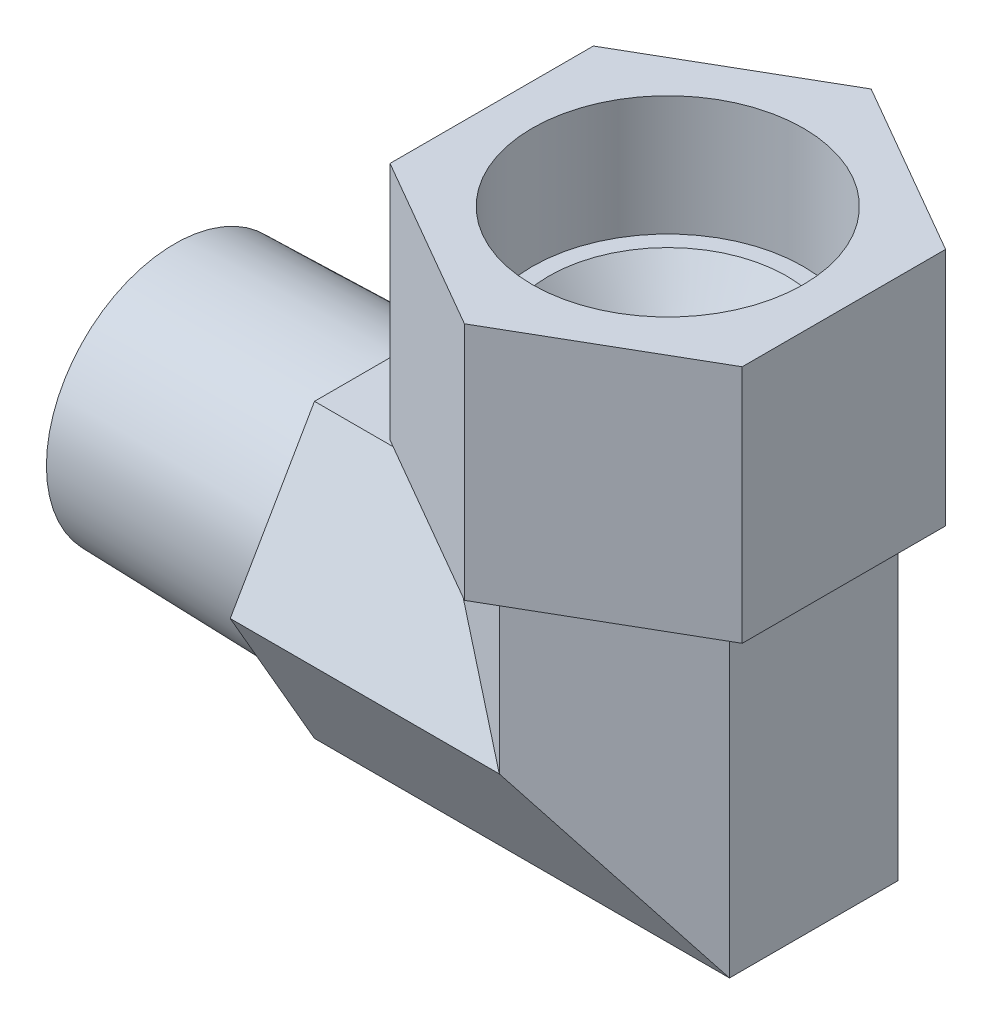
ISO-10303-21;
HEADER;
FILE_DESCRIPTION(('STEP AP214'),'2;1');
FILE_NAME('part.step','',(''),(''),'','','');
FILE_SCHEMA(('AUTOMOTIVE_DESIGN { 1 0 10303 214 1 1 1 1 }'));
ENDSEC;
DATA;
#1=APPLICATION_CONTEXT('core data for automotive mechanical design processes');
#2=APPLICATION_PROTOCOL_DEFINITION('international standard','automotive_design',2000,#1);
#3=PRODUCT_CONTEXT('',#1,'mechanical');
#4=PRODUCT('Part','Part','',(#3));
#5=PRODUCT_RELATED_PRODUCT_CATEGORY('part','',(#4));
#6=PRODUCT_DEFINITION_FORMATION('','',#4);
#7=PRODUCT_DEFINITION_CONTEXT('part definition',#1,'design');
#8=PRODUCT_DEFINITION('design','',#6,#7);
#9=PRODUCT_DEFINITION_SHAPE('','',#8);
#10=(LENGTH_UNIT() NAMED_UNIT(*) SI_UNIT(.MILLI.,.METRE.));
#11=(NAMED_UNIT(*) PLANE_ANGLE_UNIT() SI_UNIT($,.RADIAN.));
#12=(NAMED_UNIT(*) SI_UNIT($,.STERADIAN.) SOLID_ANGLE_UNIT());
#13=UNCERTAINTY_MEASURE_WITH_UNIT(LENGTH_MEASURE(1.E-05),#10,'distance_accuracy_value','');
#14=(GEOMETRIC_REPRESENTATION_CONTEXT(3) GLOBAL_UNCERTAINTY_ASSIGNED_CONTEXT((#13)) GLOBAL_UNIT_ASSIGNED_CONTEXT((#10,
#11,#12)) REPRESENTATION_CONTEXT('',''));
#15=CARTESIAN_POINT('',(0.,0.,0.));
#16=DIRECTION('',(0.,0.,1.));
#17=DIRECTION('',(1.,0.,0.));
#18=AXIS2_PLACEMENT_3D('',#15,#16,#17);
#19=CARTESIAN_POINT('',(44.45,25.908,0.));
#20=DIRECTION('',(0.,1.,0.));
#21=DIRECTION('',(0.,0.,-1.));
#22=AXIS2_PLACEMENT_3D('',#19,#20,#21);
#23=PLANE('',#22);
#24=CARTESIAN_POINT('',(44.45,25.908,0.));
#25=DIRECTION('',(0.,1.,0.));
#26=DIRECTION('',(-1.,0.,0.));
#27=AXIS2_PLACEMENT_3D('',#24,#25,#26);
#28=CIRCLE('',#27,10.7201825681273);
#29=CARTESIAN_POINT('',(33.7298174318727,25.908,0.));
#30=VERTEX_POINT('',#29);
#31=EDGE_CURVE('E349',#30,#30,#28,.F.);
#32=ORIENTED_EDGE('',*,*,#31,.T.);
#33=EDGE_LOOP('',(#32));
#34=FACE_BOUND('',#33,.T.);
#35=CARTESIAN_POINT('',(44.45,25.908,0.));
#36=DIRECTION('',(0.,1.,0.));
#37=DIRECTION('',(-1.,0.,0.));
#38=AXIS2_PLACEMENT_3D('',#35,#36,#37);
#39=CIRCLE('',#38,12.2174);
#40=CARTESIAN_POINT('',(32.2326,25.908,0.));
#41=VERTEX_POINT('',#40);
#42=EDGE_CURVE('E11',#41,#41,#39,.F.);
#43=ORIENTED_EDGE('',*,*,#42,.F.);
#44=EDGE_LOOP('',(#43));
#45=FACE_BOUND('',#44,.T.);
#46=ADVANCED_FACE('F40',(#34,#45),#23,.T.);
#47=CARTESIAN_POINT('',(44.45,-14.57292,-15.1926259235635));
#48=DIRECTION('',(-0.5,0.,-0.866025403784438));
#49=DIRECTION('',(-0.866025403784439,0.,0.5));
#50=AXIS2_PLACEMENT_3D('',#47,#48,#49);
#51=PLANE('',#50);
#52=DIRECTION('',(0.,1.,0.));
#53=VECTOR('',#52,1.);
#54=CARTESIAN_POINT('',(31.2928,-14.57292,-7.59631296178174));
#55=LINE('',#54,#53);
#56=CARTESIAN_POINT('',(31.2928,13.1572,-7.59631296178175));
#57=VERTEX_POINT('',#56);
#58=CARTESIAN_POINT('',(31.2928,15.113,-7.59631296178174));
#59=VERTEX_POINT('',#58);
#60=EDGE_CURVE('E319',#57,#59,#55,.T.);
#61=ORIENTED_EDGE('',*,*,#60,.T.);
#62=DIRECTION('',(0.866025403784439,0.,-0.5));
#63=VECTOR('',#62,1.);
#64=CARTESIAN_POINT('',(44.45,15.113,-15.1926259235635));
#65=LINE('',#64,#63);
#66=CARTESIAN_POINT('',(44.45,15.113,-15.1926259235635));
#67=VERTEX_POINT('',#66);
#68=EDGE_CURVE('E192',#59,#67,#65,.T.);
#69=ORIENTED_EDGE('',*,*,#68,.T.);
#70=DIRECTION('',(0.,1.,0.));
#71=VECTOR('',#70,1.);
#72=CARTESIAN_POINT('',(44.45,-14.57292,-15.1926259235635));
#73=LINE('',#72,#71);
#74=CARTESIAN_POINT('',(44.45,0.,-15.1926259235635));
#75=VERTEX_POINT('',#74);
#76=EDGE_CURVE('E314',#75,#67,#73,.T.);
#77=ORIENTED_EDGE('',*,*,#76,.F.);
#78=DIRECTION('',(0.654653670707977,-0.654653670707977,-0.377964473009227));
#79=VECTOR('',#78,1.);
#80=CARTESIAN_POINT('',(25.4,19.05,-4.19410329550112));
#81=LINE('',#80,#79);
#82=EDGE_CURVE('E310',#57,#75,#81,.T.);
#83=ORIENTED_EDGE('',*,*,#82,.F.);
#84=EDGE_LOOP('',(#61,#69,#77,#83));
#85=FACE_BOUND('',#84,.T.);
#86=ADVANCED_FACE('F248',(#85),#51,.T.);
#87=CARTESIAN_POINT('',(31.2928,-14.57292,-7.59631296178174));
#88=DIRECTION('',(-1.,0.,0.));
#89=DIRECTION('',(0.,0.,1.));
#90=AXIS2_PLACEMENT_3D('',#87,#88,#89);
#91=PLANE('',#90);
#92=DIRECTION('',(0.,1.,0.));
#93=VECTOR('',#92,1.);
#94=CARTESIAN_POINT('',(31.2928,-14.57292,7.59631296178174));
#95=LINE('',#94,#93);
#96=CARTESIAN_POINT('',(31.2928,13.1572,7.59631296178174));
#97=VERTEX_POINT('',#96);
#98=CARTESIAN_POINT('',(31.2928,15.113,7.59631296178174));
#99=VERTEX_POINT('',#98);
#100=EDGE_CURVE('E341',#97,#99,#95,.T.);
#101=ORIENTED_EDGE('',*,*,#100,.T.);
#102=DIRECTION('',(0.,0.,-1.));
#103=VECTOR('',#102,1.);
#104=CARTESIAN_POINT('',(31.2928,15.113,-7.59631296178174));
#105=LINE('',#104,#103);
#106=EDGE_CURVE('E189',#99,#59,#105,.T.);
#107=ORIENTED_EDGE('',*,*,#106,.T.);
#108=ORIENTED_EDGE('',*,*,#60,.F.);
#109=DIRECTION('',(0.,0.,-1.));
#110=VECTOR('',#109,1.);
#111=CARTESIAN_POINT('',(31.2928,13.1572,-7.59631296178174));
#112=LINE('',#111,#110);
#113=EDGE_CURVE('E350',#97,#57,#112,.T.);
#114=ORIENTED_EDGE('',*,*,#113,.F.);
#115=EDGE_LOOP('',(#101,#107,#108,#114));
#116=FACE_BOUND('',#115,.T.);
#117=ADVANCED_FACE('F253',(#116),#91,.T.);
#118=CARTESIAN_POINT('',(31.2928,-14.57292,7.59631296178174));
#119=DIRECTION('',(-0.5,0.,0.866025403784439));
#120=DIRECTION('',(0.866025403784439,0.,0.5));
#121=AXIS2_PLACEMENT_3D('',#118,#119,#120);
#122=PLANE('',#121);
#123=DIRECTION('',(0.,1.,0.));
#124=VECTOR('',#123,1.);
#125=CARTESIAN_POINT('',(44.45,-14.57292,15.1926259235635));
#126=LINE('',#125,#124);
#127=CARTESIAN_POINT('',(44.45,0.,15.1926259235635));
#128=VERTEX_POINT('',#127);
#129=CARTESIAN_POINT('',(44.45,15.113,15.1926259235635));
#130=VERTEX_POINT('',#129);
#131=EDGE_CURVE('E338',#128,#130,#126,.T.);
#132=ORIENTED_EDGE('',*,*,#131,.T.);
#133=DIRECTION('',(-0.866025403784439,0.,-0.5));
#134=VECTOR('',#133,1.);
#135=CARTESIAN_POINT('',(31.2928,15.113,7.59631296178174));
#136=LINE('',#135,#134);
#137=EDGE_CURVE('E186',#130,#99,#136,.T.);
#138=ORIENTED_EDGE('',*,*,#137,.T.);
#139=ORIENTED_EDGE('',*,*,#100,.F.);
#140=DIRECTION('',(-0.654653670707977,0.654653670707977,-0.377964473009227));
#141=VECTOR('',#140,1.);
#142=CARTESIAN_POINT('',(17.8816,26.5684,-0.146646968374165));
#143=LINE('',#142,#141);
#144=EDGE_CURVE('E361',#128,#97,#143,.T.);
#145=ORIENTED_EDGE('',*,*,#144,.F.);
#146=EDGE_LOOP('',(#132,#138,#139,#145));
#147=FACE_BOUND('',#146,.T.);
#148=ADVANCED_FACE('F275',(#147),#122,.T.);
#149=CARTESIAN_POINT('',(44.45,-14.57292,15.1926259235635));
#150=DIRECTION('',(0.5,0.,0.866025403784438));
#151=DIRECTION('',(0.866025403784439,0.,-0.5));
#152=AXIS2_PLACEMENT_3D('',#149,#150,#151);
#153=PLANE('',#152);
#154=DIRECTION('',(0.,1.,0.));
#155=VECTOR('',#154,1.);
#156=CARTESIAN_POINT('',(57.6072,-14.57292,7.59631296178174));
#157=LINE('',#156,#155);
#158=CARTESIAN_POINT('',(57.6072,-13.1572,7.59631296178174));
#159=VERTEX_POINT('',#158);
#160=CARTESIAN_POINT('',(57.6072,15.113,7.59631296178174));
#161=VERTEX_POINT('',#160);
#162=EDGE_CURVE('E335',#159,#161,#157,.T.);
#163=ORIENTED_EDGE('',*,*,#162,.T.);
#164=DIRECTION('',(-0.866025403784439,0.,0.5));
#165=VECTOR('',#164,1.);
#166=CARTESIAN_POINT('',(44.45,15.113,15.1926259235635));
#167=LINE('',#166,#165);
#168=EDGE_CURVE('E178',#161,#130,#167,.T.);
#169=ORIENTED_EDGE('',*,*,#168,.T.);
#170=ORIENTED_EDGE('',*,*,#131,.F.);
#171=DIRECTION('',(-0.654653670707977,0.654653670707977,0.377964473009227));
#172=VECTOR('',#171,1.);
#173=CARTESIAN_POINT('',(25.4,19.05,26.1911485516259));
#174=LINE('',#173,#172);
#175=EDGE_CURVE('E358',#159,#128,#174,.T.);
#176=ORIENTED_EDGE('',*,*,#175,.F.);
#177=EDGE_LOOP('',(#163,#169,#170,#176));
#178=FACE_BOUND('',#177,.T.);
#179=ADVANCED_FACE('F271',(#178),#153,.T.);
#180=CARTESIAN_POINT('',(57.6072,-14.57292,7.59631296178174));
#181=DIRECTION('',(1.,0.,0.));
#182=DIRECTION('',(0.,0.,-1.));
#183=AXIS2_PLACEMENT_3D('',#180,#181,#182);
#184=PLANE('',#183);
#185=DIRECTION('',(0.,1.,0.));
#186=VECTOR('',#185,1.);
#187=CARTESIAN_POINT('',(57.6072,-14.57292,-7.59631296178175));
#188=LINE('',#187,#186);
#189=CARTESIAN_POINT('',(57.6072,-13.1572,-7.59631296178175));
#190=VERTEX_POINT('',#189);
#191=CARTESIAN_POINT('',(57.6072,15.113,-7.59631296178175));
#192=VERTEX_POINT('',#191);
#193=EDGE_CURVE('E332',#190,#192,#188,.T.);
#194=ORIENTED_EDGE('',*,*,#193,.T.);
#195=DIRECTION('',(0.,0.,1.));
#196=VECTOR('',#195,1.);
#197=CARTESIAN_POINT('',(57.6072,15.113,7.59631296178174));
#198=LINE('',#197,#196);
#199=EDGE_CURVE('E56',#192,#161,#198,.T.);
#200=ORIENTED_EDGE('',*,*,#199,.T.);
#201=ORIENTED_EDGE('',*,*,#162,.F.);
#202=DIRECTION('',(0.,0.,1.));
#203=VECTOR('',#202,1.);
#204=CARTESIAN_POINT('',(57.6072,-13.1572,7.59631296178173));
#205=LINE('',#204,#203);
#206=EDGE_CURVE('E356',#190,#159,#205,.T.);
#207=ORIENTED_EDGE('',*,*,#206,.F.);
#208=EDGE_LOOP('',(#194,#200,#201,#207));
#209=FACE_BOUND('',#208,.T.);
#210=ADVANCED_FACE('F267',(#209),#184,.T.);
#211=CARTESIAN_POINT('',(57.6072,-14.57292,-7.59631296178175));
#212=DIRECTION('',(0.5,0.,-0.866025403784439));
#213=DIRECTION('',(-0.866025403784439,0.,-0.5));
#214=AXIS2_PLACEMENT_3D('',#211,#212,#213);
#215=PLANE('',#214);
#216=ORIENTED_EDGE('',*,*,#76,.T.);
#217=DIRECTION('',(0.866025403784439,0.,0.5));
#218=VECTOR('',#217,1.);
#219=CARTESIAN_POINT('',(57.6072,15.113,-7.59631296178175));
#220=LINE('',#219,#218);
#221=EDGE_CURVE('E49',#67,#192,#220,.T.);
#222=ORIENTED_EDGE('',*,*,#221,.T.);
#223=ORIENTED_EDGE('',*,*,#193,.F.);
#224=DIRECTION('',(0.654653670707977,-0.654653670707977,0.377964473009227));
#225=VECTOR('',#224,1.);
#226=CARTESIAN_POINT('',(32.9184,11.5316,-21.8503982877506));
#227=LINE('',#226,#225);
#228=EDGE_CURVE('E331',#75,#190,#227,.T.);
#229=ORIENTED_EDGE('',*,*,#228,.F.);
#230=EDGE_LOOP('',(#216,#222,#223,#229));
#231=FACE_BOUND('',#230,.T.);
#232=ADVANCED_FACE('F263',(#231),#215,.T.);
#233=CARTESIAN_POINT('',(0.,-13.1572,-7.59631296178175));
#234=DIRECTION('',(0.,-0.5,-0.866025403784439));
#235=DIRECTION('',(0.,0.866025403784439,-0.5));
#236=AXIS2_PLACEMENT_3D('',#233,#234,#235);
#237=PLANE('',#236);
#238=DIRECTION('',(1.,0.,0.));
#239=VECTOR('',#238,1.);
#240=CARTESIAN_POINT('',(0.,-13.1572,-7.59631296178175));
#241=LINE('',#240,#239);
#242=CARTESIAN_POINT('',(20.19808,-13.1572,-7.59631296178175));
#243=VERTEX_POINT('',#242);
#244=EDGE_CURVE('E328',#243,#190,#241,.T.);
#245=ORIENTED_EDGE('',*,*,#244,.F.);
#246=DIRECTION('',(0.,0.866025403784439,-0.5));
#247=VECTOR('',#246,1.);
#248=CARTESIAN_POINT('',(20.19808,-13.1572,-7.59631296178175));
#249=LINE('',#248,#247);
#250=CARTESIAN_POINT('',(20.19808,0.,-15.1926259235635));
#251=VERTEX_POINT('',#250);
#252=EDGE_CURVE('E200',#243,#251,#249,.T.);
#253=ORIENTED_EDGE('',*,*,#252,.T.);
#254=DIRECTION('',(1.,0.,0.));
#255=VECTOR('',#254,1.);
#256=CARTESIAN_POINT('',(0.,0.,-15.1926259235635));
#257=LINE('',#256,#255);
#258=EDGE_CURVE('E307',#251,#75,#257,.T.);
#259=ORIENTED_EDGE('',*,*,#258,.T.);
#260=ORIENTED_EDGE('',*,*,#228,.T.);
#261=EDGE_LOOP('',(#245,#253,#259,#260));
#262=FACE_BOUND('',#261,.T.);
#263=ADVANCED_FACE('F266',(#262),#237,.T.);
#264=CARTESIAN_POINT('',(0.,-13.1572,7.59631296178174));
#265=DIRECTION('',(0.,-1.,0.));
#266=DIRECTION('',(0.,0.,-1.));
#267=AXIS2_PLACEMENT_3D('',#264,#265,#266);
#268=PLANE('',#267);
#269=DIRECTION('',(1.,0.,0.));
#270=VECTOR('',#269,1.);
#271=CARTESIAN_POINT('',(0.,-13.1572,7.59631296178174));
#272=LINE('',#271,#270);
#273=CARTESIAN_POINT('',(20.19808,-13.1572,7.59631296178174));
#274=VERTEX_POINT('',#273);
#275=EDGE_CURVE('E326',#274,#159,#272,.T.);
#276=ORIENTED_EDGE('',*,*,#275,.F.);
#277=DIRECTION('',(0.,0.,-1.));
#278=VECTOR('',#277,1.);
#279=CARTESIAN_POINT('',(20.19808,-13.1572,7.59631296178174));
#280=LINE('',#279,#278);
#281=EDGE_CURVE('E196',#274,#243,#280,.T.);
#282=ORIENTED_EDGE('',*,*,#281,.T.);
#283=ORIENTED_EDGE('',*,*,#244,.T.);
#284=ORIENTED_EDGE('',*,*,#206,.T.);
#285=EDGE_LOOP('',(#276,#282,#283,#284));
#286=FACE_BOUND('',#285,.T.);
#287=ADVANCED_FACE('F285',(#286),#268,.T.);
#288=CARTESIAN_POINT('',(0.,0.,15.1926259235635));
#289=DIRECTION('',(0.,-0.5,0.866025403784438));
#290=DIRECTION('',(0.,-0.866025403784439,-0.5));
#291=AXIS2_PLACEMENT_3D('',#288,#289,#290);
#292=PLANE('',#291);
#293=DIRECTION('',(1.,0.,0.));
#294=VECTOR('',#293,1.);
#295=CARTESIAN_POINT('',(0.,0.,15.1926259235635));
#296=LINE('',#295,#294);
#297=CARTESIAN_POINT('',(20.19808,0.,15.1926259235635));
#298=VERTEX_POINT('',#297);
#299=EDGE_CURVE('E324',#298,#128,#296,.T.);
#300=ORIENTED_EDGE('',*,*,#299,.F.);
#301=DIRECTION('',(0.,-0.866025403784439,-0.5));
#302=VECTOR('',#301,1.);
#303=CARTESIAN_POINT('',(20.19808,0.,15.1926259235635));
#304=LINE('',#303,#302);
#305=EDGE_CURVE('E195',#298,#274,#304,.T.);
#306=ORIENTED_EDGE('',*,*,#305,.T.);
#307=ORIENTED_EDGE('',*,*,#275,.T.);
#308=ORIENTED_EDGE('',*,*,#175,.T.);
#309=EDGE_LOOP('',(#300,#306,#307,#308));
#310=FACE_BOUND('',#309,.T.);
#311=ADVANCED_FACE('F289',(#310),#292,.T.);
#312=CARTESIAN_POINT('',(0.,13.1572,7.59631296178174));
#313=DIRECTION('',(0.,0.5,0.866025403784439));
#314=DIRECTION('',(0.,-0.866025403784439,0.5));
#315=AXIS2_PLACEMENT_3D('',#312,#313,#314);
#316=PLANE('',#315);
#317=DIRECTION('',(1.,0.,0.));
#318=VECTOR('',#317,1.);
#319=CARTESIAN_POINT('',(0.,13.1572,7.59631296178174));
#320=LINE('',#319,#318);
#321=CARTESIAN_POINT('',(20.19808,13.1572,7.59631296178174));
#322=VERTEX_POINT('',#321);
#323=EDGE_CURVE('E316',#322,#97,#320,.T.);
#324=ORIENTED_EDGE('',*,*,#323,.F.);
#325=DIRECTION('',(0.,-0.866025403784439,0.5));
#326=VECTOR('',#325,1.);
#327=CARTESIAN_POINT('',(20.19808,13.1572,7.59631296178174));
#328=LINE('',#327,#326);
#329=EDGE_CURVE('E203',#322,#298,#328,.T.);
#330=ORIENTED_EDGE('',*,*,#329,.T.);
#331=ORIENTED_EDGE('',*,*,#299,.T.);
#332=ORIENTED_EDGE('',*,*,#144,.T.);
#333=EDGE_LOOP('',(#324,#330,#331,#332));
#334=FACE_BOUND('',#333,.T.);
#335=ADVANCED_FACE('F293',(#334),#316,.T.);
#336=CARTESIAN_POINT('',(0.,13.1572,-7.59631296178174));
#337=DIRECTION('',(0.,1.,0.));
#338=DIRECTION('',(0.,0.,1.));
#339=AXIS2_PLACEMENT_3D('',#336,#337,#338);
#340=PLANE('',#339);
#341=DIRECTION('',(1.,0.,0.));
#342=VECTOR('',#341,1.);
#343=CARTESIAN_POINT('',(0.,13.1572,-7.59631296178174));
#344=LINE('',#343,#342);
#345=CARTESIAN_POINT('',(20.19808,13.1572,-7.59631296178174));
#346=VERTEX_POINT('',#345);
#347=EDGE_CURVE('E313',#346,#57,#344,.T.);
#348=ORIENTED_EDGE('',*,*,#347,.F.);
#349=DIRECTION('',(0.,0.,1.));
#350=VECTOR('',#349,1.);
#351=CARTESIAN_POINT('',(20.19808,13.1572,-7.59631296178174));
#352=LINE('',#351,#350);
#353=EDGE_CURVE('E64',#346,#322,#352,.T.);
#354=ORIENTED_EDGE('',*,*,#353,.T.);
#355=ORIENTED_EDGE('',*,*,#323,.T.);
#356=ORIENTED_EDGE('',*,*,#113,.T.);
#357=EDGE_LOOP('',(#348,#354,#355,#356));
#358=FACE_BOUND('',#357,.T.);
#359=ADVANCED_FACE('F297',(#358),#340,.T.);
#360=CARTESIAN_POINT('',(0.,0.,-15.1926259235635));
#361=DIRECTION('',(0.,0.5,-0.866025403784438));
#362=DIRECTION('',(0.,0.866025403784439,0.5));
#363=AXIS2_PLACEMENT_3D('',#360,#361,#362);
#364=PLANE('',#363);
#365=ORIENTED_EDGE('',*,*,#258,.F.);
#366=DIRECTION('',(0.,0.866025403784439,0.5));
#367=VECTOR('',#366,1.);
#368=CARTESIAN_POINT('',(20.19808,0.,-15.1926259235635));
#369=LINE('',#368,#367);
#370=EDGE_CURVE('E207',#251,#346,#369,.T.);
#371=ORIENTED_EDGE('',*,*,#370,.T.);
#372=ORIENTED_EDGE('',*,*,#347,.T.);
#373=ORIENTED_EDGE('',*,*,#82,.T.);
#374=EDGE_LOOP('',(#365,#371,#372,#373));
#375=FACE_BOUND('',#374,.T.);
#376=ADVANCED_FACE('F261',(#375),#364,.T.);
#377=CARTESIAN_POINT('',(0.,0.,0.));
#378=DIRECTION('',(1.,0.,0.));
#379=DIRECTION('',(0.,0.,-1.));
#380=AXIS2_PLACEMENT_3D('',#377,#378,#379);
#381=PLANE('',#380);
#382=CARTESIAN_POINT('',(0.,0.,0.));
#383=DIRECTION('',(-1.,0.,0.));
#384=DIRECTION('',(0.,0.,1.));
#385=AXIS2_PLACEMENT_3D('',#382,#383,#384);
#386=CIRCLE('',#385,9.1313);
#387=CARTESIAN_POINT('',(0.,0.,9.1313));
#388=VERTEX_POINT('',#387);
#389=EDGE_CURVE('E224',#388,#388,#386,.T.);
#390=ORIENTED_EDGE('',*,*,#389,.F.);
#391=EDGE_LOOP('',(#390));
#392=FACE_BOUND('',#391,.T.);
#393=CARTESIAN_POINT('',(0.,0.,0.));
#394=DIRECTION('',(-1.,0.,0.));
#395=DIRECTION('',(0.,0.,1.));
#396=AXIS2_PLACEMENT_3D('',#393,#394,#395);
#397=CIRCLE('',#396,11.56335);
#398=CARTESIAN_POINT('',(0.,0.,11.56335));
#399=VERTEX_POINT('',#398);
#400=EDGE_CURVE('E199',#399,#399,#397,.T.);
#401=ORIENTED_EDGE('',*,*,#400,.T.);
#402=EDGE_LOOP('',(#401));
#403=FACE_BOUND('',#402,.T.);
#404=ADVANCED_FACE('F244',(#392,#403),#381,.F.);
#405=CARTESIAN_POINT('',(52.1843,0.,0.));
#406=DIRECTION('',(-1.,0.,0.));
#407=DIRECTION('',(0.,0.,1.));
#408=AXIS2_PLACEMENT_3D('',#405,#406,#407);
#409=CYLINDRICAL_SURFACE('',#408,9.1313);
#410=CARTESIAN_POINT('',(52.1843,0.,0.));
#411=DIRECTION('',(-1.,0.,0.));
#412=DIRECTION('',(0.,0.,1.));
#413=AXIS2_PLACEMENT_3D('',#410,#411,#412);
#414=CIRCLE('',#413,9.1313);
#415=CARTESIAN_POINT('',(52.1843,9.1313,0.));
#416=VERTEX_POINT('',#415);
#417=EDGE_CURVE('E225',#416,#416,#414,.T.);
#418=ORIENTED_EDGE('',*,*,#417,.F.);
#419=CARTESIAN_POINT('',(52.1843,9.1313,0.));
#420=CARTESIAN_POINT('',(52.1843021259248,9.13130209261446,-0.182758832256139));
#421=CARTESIAN_POINT('',(52.1778131392299,9.12580369423186,-0.36549440025149));
#422=CARTESIAN_POINT('',(52.1519842527275,9.10394178825008,-0.729466055536468));
#423=CARTESIAN_POINT('',(52.1326402005505,9.0875747699329,-0.910701639152003));
#424=CARTESIAN_POINT('',(52.0814340362446,9.04432646880311,-1.27028810766286));
#425=CARTESIAN_POINT('',(52.0495599520383,9.01743513042135,-1.4486360633251));
#426=CARTESIAN_POINT('',(51.9738410575725,8.95371482993896,-1.8010297459014));
#427=CARTESIAN_POINT('',(51.929991034014,8.91688154004529,-1.97507356309508));
#428=CARTESIAN_POINT('',(51.8313703692041,8.83431660310183,-2.31649079281074));
#429=CARTESIAN_POINT('',(51.7766767364978,8.78864775625327,-2.48390178485555));
#430=CARTESIAN_POINT('',(51.6569241206235,8.68906738830047,-2.81251512625064));
#431=CARTESIAN_POINT('',(51.5918606078699,8.6351522656227,-2.97371472406491));
#432=CARTESIAN_POINT('',(51.4521915645336,8.51999811748607,-3.2891419807747));
#433=CARTESIAN_POINT('',(51.3775884998985,8.45876098501104,-3.44337142753927));
#434=CARTESIAN_POINT('',(51.2195829867585,8.32985061736718,-3.74447103247304));
#435=CARTESIAN_POINT('',(51.1361786452727,8.26217599793187,-3.8913395974022));
#436=CARTESIAN_POINT('',(50.9285182179136,8.0948968633042,-4.23099273776876));
#437=CARTESIAN_POINT('',(50.8006609075396,7.99282622222324,-4.42037369383199));
#438=CARTESIAN_POINT('',(50.5312593253204,7.78049344967678,-4.78424174126542));
#439=CARTESIAN_POINT('',(50.3897103083673,7.67022848140921,-4.95872362936591));
#440=CARTESIAN_POINT('',(50.0938465418905,7.44346603718392,-5.29304680161234));
#441=CARTESIAN_POINT('',(49.9395011419127,7.32695384781621,-5.45285088123274));
#442=CARTESIAN_POINT('',(49.6192720182565,7.0902032258028,-5.75732934383582));
#443=CARTESIAN_POINT('',(49.4533897928907,6.96996527814984,-5.9020056854036));
#444=CARTESIAN_POINT('',(49.1072261551589,6.7257445202904,-6.17897540317764));
#445=CARTESIAN_POINT('',(48.9267271749369,6.6017343891641,-6.31097261548809));
#446=CARTESIAN_POINT('',(48.5542710800364,6.3550593439477,-6.55930535072935));
#447=CARTESIAN_POINT('',(48.3623101710614,6.2323948914092,-6.67563564541271));
#448=CARTESIAN_POINT('',(47.9670501472771,5.99218557191084,-6.89205360138539));
#449=CARTESIAN_POINT('',(47.7637773279319,5.87462987703066,-6.9921769783031));
#450=CARTESIAN_POINT('',(47.3449964857015,5.64899130465389,-7.17569913816402));
#451=CARTESIAN_POINT('',(47.129498823805,5.54090059720271,-7.25911182010942));
#452=CARTESIAN_POINT('',(46.6691290198648,5.33298258140594,-7.41335557806165));
#453=CARTESIAN_POINT('',(46.4232586877707,5.2343051417107,-7.48285398137573));
#454=CARTESIAN_POINT('',(46.0435991077829,5.10750767873944,-7.56945552440247));
#455=CARTESIAN_POINT('',(45.9153158027654,5.06879490721896,-7.59537159533214));
#456=CARTESIAN_POINT('',(45.6554241281155,4.99986064241177,-7.64092500841592));
#457=CARTESIAN_POINT('',(45.5238175727,4.96963462081403,-7.66056569972561));
#458=CARTESIAN_POINT('',(45.2559569286409,4.91866765749506,-7.69339265955306));
#459=CARTESIAN_POINT('',(45.1196631626379,4.89807008990913,-7.70648155828903));
#460=CARTESIAN_POINT('',(44.8453349965823,4.86815711983594,-7.72541284526291));
#461=CARTESIAN_POINT('',(44.7073007661205,4.85884062657517,-7.73125593410365));
#462=CARTESIAN_POINT('',(44.4308766177248,4.85206567764081,-7.73551029243041));
#463=CARTESIAN_POINT('',(44.2924868813226,4.85460204835207,-7.73392480438921));
#464=CARTESIAN_POINT('',(44.0167321398647,4.87134238035158,-7.72338944471553));
#465=CARTESIAN_POINT('',(43.8793671393202,4.88554639297269,-7.71443954068263));
#466=CARTESIAN_POINT('',(43.5097613290923,4.93884407001978,-7.68050265137467));
#467=CARTESIAN_POINT('',(43.279616806066,4.98845905964957,-7.6486339887059));
#468=CARTESIAN_POINT('',(42.8297073916023,5.11267172046246,-7.5661520868028));
#469=CARTESIAN_POINT('',(42.6099587150176,5.18730704016383,-7.51551058753831));
#470=CARTESIAN_POINT('',(42.1993297816635,5.34733284406692,-7.40239769039444));
#471=CARTESIAN_POINT('',(42.0075507992214,5.43136986153646,-7.34121029663725));
#472=CARTESIAN_POINT('',(41.6333840368712,5.60958748812886,-7.20594817572123));
#473=CARTESIAN_POINT('',(41.4510035917918,5.7037758475468,-7.13186357493707));
#474=CARTESIAN_POINT('',(41.094832221142,5.89882624233285,-6.97140497022733));
#475=CARTESIAN_POINT('',(40.9210637066126,5.99970424083157,-6.88500096015515));
#476=CARTESIAN_POINT('',(40.5821915150322,6.20508195639111,-6.7004969200201));
#477=CARTESIAN_POINT('',(40.4170857483932,6.30958078985878,-6.60239972938577));
#478=CARTESIAN_POINT('',(40.0836248122466,6.52759020376524,-6.38720048491272));
#479=CARTESIAN_POINT('',(39.9158943277996,6.64120710311508,-6.26923796938896));
#480=CARTESIAN_POINT('',(39.590026620015,6.86781558712552,-6.02014219080409));
#481=CARTESIAN_POINT('',(39.4318904811535,6.98080709978997,-5.88900744328034));
#482=CARTESIAN_POINT('',(39.1257642577505,7.20401148380768,-5.61375225000359));
#483=CARTESIAN_POINT('',(38.9777598859427,7.31422812333533,-5.46965078227795));
#484=CARTESIAN_POINT('',(38.6922221039652,7.53024146340812,-5.168219373551));
#485=CARTESIAN_POINT('',(38.5546914810879,7.63603698404058,-5.01088593451334));
#486=CARTESIAN_POINT('',(38.3039456717165,7.83132623383662,-4.69908779748299));
#487=CARTESIAN_POINT('',(38.1896675793718,7.92140289723163,-4.54584399069863));
#488=CARTESIAN_POINT('',(37.9712965427456,8.09508885025238,-4.22880989799072));
#489=CARTESIAN_POINT('',(37.86720170309,8.17869934279535,-4.06502158412631));
#490=CARTESIAN_POINT('',(37.670259348195,8.33803217250565,-3.72729122012735));
#491=CARTESIAN_POINT('',(37.5774051242686,8.41375921090257,-3.55335531911994));
#492=CARTESIAN_POINT('',(37.4040338393988,8.55595835074406,-3.19581089941628));
#493=CARTESIAN_POINT('',(37.3235145719154,8.62243210726821,-3.01220411861183));
#494=CARTESIAN_POINT('',(37.1880397606067,8.73476511534141,-2.66681827721512));
#495=CARTESIAN_POINT('',(37.1310564988889,8.78221861973037,-2.506351164483));
#496=CARTESIAN_POINT('',(37.0273078154328,8.86886620499606,-2.17998677418589));
#497=CARTESIAN_POINT('',(36.9805404510679,8.90806185611277,-2.01409053591914));
#498=CARTESIAN_POINT('',(36.8978996588199,8.97746956834795,-1.67783639265092));
#499=CARTESIAN_POINT('',(36.8620212845029,9.00768570836992,-1.50748055178674));
#500=CARTESIAN_POINT('',(36.8016957640238,9.05856157703404,-1.16333725978695));
#501=CARTESIAN_POINT('',(36.7772487399451,9.07922120361562,-0.989549772023095));
#502=CARTESIAN_POINT('',(36.7401341480288,9.110607877814,-0.639154365433089));
#503=CARTESIAN_POINT('',(36.727511478576,9.12129706592144,-0.462538265660885));
#504=CARTESIAN_POINT('',(36.7144334703874,9.13237212032375,-0.108530906265329));
#505=CARTESIAN_POINT('',(36.7139781472991,9.13275797336824,0.0688603543546085));
#506=CARTESIAN_POINT('',(36.7252429326387,9.12321796920426,0.422974116497961));
#507=CARTESIAN_POINT('',(36.7369630192536,9.11329213046986,0.599696619218931));
#508=CARTESIAN_POINT('',(36.7723671374694,9.08334742261156,0.951066978261854));
#509=CARTESIAN_POINT('',(36.7960509244791,9.06332875982985,1.12571487692322));
#510=CARTESIAN_POINT('',(36.8532530037852,9.01507555275805,1.46155372278202));
#511=CARTESIAN_POINT('',(36.8861178673573,8.98738768253974,1.62293583221198));
#512=CARTESIAN_POINT('',(36.9616382412921,8.92392212341065,1.94182780657954));
#513=CARTESIAN_POINT('',(37.0042974860535,8.88814134891732,2.09933616911085));
#514=CARTESIAN_POINT('',(37.0988506509753,8.8090843617613,2.40962833574182));
#515=CARTESIAN_POINT('',(37.1507451757157,8.76580765838863,2.56241182976274));
#516=CARTESIAN_POINT('',(37.2631733638578,8.67241268884165,2.86262548680624));
#517=CARTESIAN_POINT('',(37.3237086789272,8.62229311474774,3.01005461958052));
#518=CARTESIAN_POINT('',(37.4749126314555,8.49768626706725,3.3485326864655));
#519=CARTESIAN_POINT('',(37.5688038404357,8.42072968807329,3.5372426434582));
#520=CARTESIAN_POINT('',(37.7696438772001,8.25741988274746,3.90331416844404));
#521=CARTESIAN_POINT('',(37.8765966235358,8.17106383735979,4.08067230637106));
#522=CARTESIAN_POINT('',(38.1024035678247,7.99053289163071,4.42375889169605));
#523=CARTESIAN_POINT('',(38.2212719957704,7.89634866617336,4.58947302217913));
#524=CARTESIAN_POINT('',(38.4697056951043,7.70189477806704,4.9088089390156));
#525=CARTESIAN_POINT('',(38.5992702006735,7.60162555122859,5.06243158956033));
#526=CARTESIAN_POINT('',(38.8703362469606,7.39500298766052,5.35983778607367));
#527=CARTESIAN_POINT('',(39.0119918011616,7.28857939284668,5.50343170173235));
#528=CARTESIAN_POINT('',(39.3048313514417,7.0727786551497,5.77814415352572));
#529=CARTESIAN_POINT('',(39.4560160469691,6.96340129579491,5.90926177211114));
#530=CARTESIAN_POINT('',(39.7675749421123,6.74345334491678,6.15907260419027));
#531=CARTESIAN_POINT('',(39.9279513899796,6.63288246687961,6.27776275775405));
#532=CARTESIAN_POINT('',(40.2577575636822,6.41257042874029,6.50264089477237));
#533=CARTESIAN_POINT('',(40.4271860667872,6.3028291588511,6.6088305605872));
#534=CARTESIAN_POINT('',(40.7481259789298,6.10343207185446,6.79295165397153));
#535=CARTESIAN_POINT('',(40.8983057798458,6.01331499059694,6.87270665131897));
#536=CARTESIAN_POINT('',(41.2055499582664,5.83710903684618,7.02297646020812));
#537=CARTESIAN_POINT('',(41.3626151054024,5.75102061690431,7.09349023525044));
#538=CARTESIAN_POINT('',(41.6837700677538,5.58519476869429,7.22477710129344));
#539=CARTESIAN_POINT('',(41.8478503872938,5.50544914874364,7.28556286218978));
#540=CARTESIAN_POINT('',(42.1833880101453,5.3550210249323,7.39683293641384));
#541=CARTESIAN_POINT('',(42.3548417878573,5.28433425256426,7.44732210815093));
#542=CARTESIAN_POINT('',(42.766708313204,5.13288837302481,7.55283778723164));
#543=CARTESIAN_POINT('',(43.0103137185419,5.05721660081154,7.60330377604984));
#544=CARTESIAN_POINT('',(43.3839285907432,4.96821022692935,7.6615130880899));
#545=CARTESIAN_POINT('',(43.5097386401995,4.94263486061702,7.67799550750666));
#546=CARTESIAN_POINT('',(43.7635080645549,4.9007029412139,7.70482802082367));
#547=CARTESIAN_POINT('',(43.8914663101797,4.88434169158567,7.71518123898383));
#548=CARTESIAN_POINT('',(44.1497552282677,4.86155344801671,7.72956177529159));
#549=CARTESIAN_POINT('',(44.2800968566791,4.85521419052091,7.73353322988358));
#550=CARTESIAN_POINT('',(44.5408980025853,4.85309228664598,7.73486501129994));
#551=CARTESIAN_POINT('',(44.6713575163707,4.85730931892096,7.73222553936869));
#552=CARTESIAN_POINT('',(44.9313472102603,4.87607481538034,7.7204050473092));
#553=CARTESIAN_POINT('',(45.0608763752675,4.89063321751651,7.71121773474405));
#554=CARTESIAN_POINT('',(45.3179307846144,4.92933844376239,7.68653259967649));
#555=CARTESIAN_POINT('',(45.4454548374535,4.95349076048568,7.67103116214389));
#556=CARTESIAN_POINT('',(45.7277143151109,5.0170366388476,7.62966183246691));
#557=CARTESIAN_POINT('',(45.8817067047483,5.05868907047823,7.60220515647976));
#558=CARTESIAN_POINT('',(46.1846501165614,5.15261781365882,7.53885723932274));
#559=CARTESIAN_POINT('',(46.3335982604553,5.20490007536264,7.502961272408));
#560=CARTESIAN_POINT('',(46.6265477455337,5.31792075334864,7.42328408841997));
#561=CARTESIAN_POINT('',(46.7705339795456,5.37868256170097,7.37948095665819));
#562=CARTESIAN_POINT('',(47.0531355507217,5.50651355262926,7.28459297656707));
#563=CARTESIAN_POINT('',(47.1917515536755,5.57358194977171,7.23350903459489));
#564=CARTESIAN_POINT('',(47.5488041496769,5.7556562983562,7.09038372305959));
#565=CARTESIAN_POINT('',(47.7630532942366,5.87445210931683,6.99268110239336));
#566=CARTESIAN_POINT('',(48.1789168260953,6.11864240550582,6.78005438455317));
#567=CARTESIAN_POINT('',(48.3805239067386,6.24404063106222,6.66512045607424));
#568=CARTESIAN_POINT('',(48.7718022931777,6.4974608715664,6.41833085801002));
#569=CARTESIAN_POINT('',(48.9614583370501,6.6254859753658,6.28645417947101));
#570=CARTESIAN_POINT('',(49.328544108116,6.8807021883517,6.00604109395033));
#571=CARTESIAN_POINT('',(49.5059764192249,7.00789346862064,5.85750822539118));
#572=CARTESIAN_POINT('',(49.8539201472079,7.26285965353201,5.53846516582557));
#573=CARTESIAN_POINT('',(50.0240017240947,7.39051184732457,5.36738615111874));
#574=CARTESIAN_POINT('',(50.3496187972142,7.63909029907412,5.00727616089094));
#575=CARTESIAN_POINT('',(50.5051513690125,7.76001520283551,4.81824159152343));
#576=CARTESIAN_POINT('',(50.7996409258009,7.99193212356742,4.42290089728005));
#577=CARTESIAN_POINT('',(50.9386398053284,8.10294905972574,4.21664078200757));
#578=CARTESIAN_POINT('',(51.1983969739653,8.31241311995072,3.78701109438317));
#579=CARTESIAN_POINT('',(51.3191663373748,8.41086786978502,3.56365203483973));
#580=CARTESIAN_POINT('',(51.5034350690138,8.56215059383481,3.17770925868447));
#581=CARTESIAN_POINT('',(51.5726504260601,8.61928667304005,3.01951397628618));
#582=CARTESIAN_POINT('',(51.7010729066676,8.72570958660548,2.69657415494854));
#583=CARTESIAN_POINT('',(51.7602827535344,8.77499855658443,2.53183141322831));
#584=CARTESIAN_POINT('',(51.8678371093292,8.86479984056698,2.19681230000542));
#585=CARTESIAN_POINT('',(51.9161994683625,8.9053265692716,2.02654555507329));
#586=CARTESIAN_POINT('',(52.0014474833152,8.97691861316676,1.68126592806156));
#587=CARTESIAN_POINT('',(52.0383364562833,9.00798666288291,1.50625443366482));
#588=CARTESIAN_POINT('',(52.10718991535,9.06605632710883,1.11161222888874));
#589=CARTESIAN_POINT('',(52.1360341275475,9.09044879464971,0.891036879948687));
#590=CARTESIAN_POINT('',(52.174590184387,9.12307130673446,0.446963222805779));
#591=CARTESIAN_POINT('',(52.1842974005736,9.13129744130309,0.223464220645065));
#592=CARTESIAN_POINT('',(52.1843,9.1313,0.));
#593=B_SPLINE_CURVE_WITH_KNOTS('',3,(#419,#420,#421,#422,#423,#424,#425,#426,#427,#428,#429,
#430,#431,#432,#433,#434,#435,#436,#437,#438,#439,#440,#441,#442,#443,#444,#445,#446,#447,#448,
#449,#450,#451,#452,#453,#454,#455,#456,#457,#458,#459,#460,#461,#462,#463,#464,#465,#466,#467,
#468,#469,#470,#471,#472,#473,#474,#475,#476,#477,#478,#479,#480,#481,#482,#483,#484,#485,#486,
#487,#488,#489,#490,#491,#492,#493,#494,#495,#496,#497,#498,#499,#500,#501,#502,#503,#504,#505,
#506,#507,#508,#509,#510,#511,#512,#513,#514,#515,#516,#517,#518,#519,#520,#521,#522,#523,#524,
#525,#526,#527,#528,#529,#530,#531,#532,#533,#534,#535,#536,#537,#538,#539,#540,#541,#542,#543,
#544,#545,#546,#547,#548,#549,#550,#551,#552,#553,#554,#555,#556,#557,#558,#559,#560,#561,#562,
#563,#564,#565,#566,#567,#568,#569,#570,#571,#572,#573,#574,#575,#576,#577,#578,#579,#580,#581,
#582,#583,#584,#585,#586,#587,#588,#589,#590,#591,#592),.UNSPECIFIED.,.T.,.F.,(4,2,2,2,2,2,2,2,
2,2,2,2,2,2,2,2,2,2,2,2,2,2,2,2,2,2,2,2,2,2,2,2,2,2,2,2,2,2,2,2,2,2,2,2,2,2,2,2,2,2,2,2,2,2,2,2,
2,2,2,2,2,2,2,2,2,2,2,2,2,2,2,2,2,2,2,2,2,2,2,2,2,2,2,2,2,2,4),(0.,0.548040631445376,
1.09625837393367,1.64500120049582,2.19398328452163,2.73919794386704,3.28465141012599,
3.82996416214559,4.375394440143,5.12509527070801,5.87505686094891,6.62686977930098,
7.37858523975296,8.14494592539637,8.91156172486384,9.67646440917819,10.4407282253686,
11.2598444292655,11.6689199814246,12.0777768448096,12.4925418265245,12.9072667011731,
13.321810570923,13.7363562645062,14.4461058106067,15.1569281587838,15.810403879802,
16.4643820955455,17.1199813038022,17.775421637461,18.4781408779345,19.1809394013512,
19.8827255424868,20.5846977962424,21.2181031300863,21.8513903451476,22.4842977150486,
23.1170917347067,23.6468799609222,24.1765673562129,24.7060137742531,25.2354658464847,
25.7669202534621,26.2983753439047,26.8298294822127,27.361272755676,27.861750671934,
28.3624197280889,28.863121572204,29.3639192528443,30.0361038685653,30.7084906420034,
31.3816901848484,32.0548415696111,32.7384367732823,33.4220822120738,34.1058955863238,
34.7896168250568,35.3666098314807,35.9436674983987,36.519967371378,37.095994686909,
37.8729507646706,38.2608556743063,38.6485626851406,39.0396454041637,39.4307162183137,
39.8221633568746,40.2138349266483,40.6986759977147,41.1837892143366,41.6702681608576,
42.1566866004885,42.9467436660883,43.7372532255558,44.5287526499942,45.3200842465796,
46.1378777406036,46.9558352642233,47.7716739098228,48.5870149271998,49.1321635198284,
49.677163493764,50.2212599527171,50.7651989624491,51.4351412136858,52.1052454766422),.UNSPECIFIED.);
#594=EDGE_CURVE('E216',#416,#416,#593,.T.);
#595=ORIENTED_EDGE('',*,*,#594,.T.);
#596=EDGE_LOOP('',(#418,#595));
#597=FACE_BOUND('',#596,.T.);
#598=ORIENTED_EDGE('',*,*,#389,.T.);
#599=EDGE_LOOP('',(#598));
#600=FACE_BOUND('',#599,.T.);
#601=ADVANCED_FACE('F227',(#597,#600),#409,.F.);
#602=CARTESIAN_POINT('',(52.1843,0.,0.));
#603=DIRECTION('',(-1.,0.,0.));
#604=DIRECTION('',(0.,0.,1.));
#605=AXIS2_PLACEMENT_3D('',#602,#603,#604);
#606=PLANE('',#605);
#607=ORIENTED_EDGE('',*,*,#417,.T.);
#608=EDGE_LOOP('',(#607));
#609=FACE_BOUND('',#608,.T.);
#610=ADVANCED_FACE('F235',(#609),#606,.T.);
#611=CARTESIAN_POINT('',(44.45,0.,0.));
#612=DIRECTION('',(0.,1.,0.));
#613=DIRECTION('',(-1.,0.,0.));
#614=AXIS2_PLACEMENT_3D('',#611,#612,#613);
#615=CYLINDRICAL_SURFACE('',#614,7.7343);
#616=CARTESIAN_POINT('',(44.45,21.9456,0.));
#617=DIRECTION('',(0.,1.,0.));
#618=DIRECTION('',(0.,0.,1.));
#619=AXIS2_PLACEMENT_3D('',#616,#617,#618);
#620=CIRCLE('',#619,7.7343);
#621=CARTESIAN_POINT('',(44.45,21.9456,7.7343));
#622=VERTEX_POINT('',#621);
#623=EDGE_CURVE('E346',#622,#622,#620,.T.);
#624=ORIENTED_EDGE('',*,*,#623,.T.);
#625=EDGE_LOOP('',(#624));
#626=FACE_BOUND('',#625,.T.);
#627=ORIENTED_EDGE('',*,*,#594,.F.);
#628=EDGE_LOOP('',(#627));
#629=FACE_BOUND('',#628,.T.);
#630=ADVANCED_FACE('F231',(#626,#629),#615,.F.);
#631=CARTESIAN_POINT('',(44.45,21.9456,0.));
#632=DIRECTION('',(0.,1.,0.));
#633=DIRECTION('',(0.,0.,1.));
#634=AXIS2_PLACEMENT_3D('',#631,#632,#633);
#635=CONICAL_SURFACE('',#634,7.7343,0.6457718232379);
#636=ORIENTED_EDGE('',*,*,#31,.F.);
#637=EDGE_LOOP('',(#636));
#638=FACE_BOUND('',#637,.T.);
#639=ORIENTED_EDGE('',*,*,#623,.F.);
#640=EDGE_LOOP('',(#639));
#641=FACE_BOUND('',#640,.T.);
#642=ADVANCED_FACE('F43',(#638,#641),#635,.F.);
#643=CARTESIAN_POINT('',(20.19808,0.,0.));
#644=DIRECTION('',(-1.,0.,0.));
#645=DIRECTION('',(0.,0.,1.));
#646=AXIS2_PLACEMENT_3D('',#643,#644,#645);
#647=PLANE('',#646);
#648=CARTESIAN_POINT('',(20.19808,0.,0.));
#649=DIRECTION('',(-1.,0.,0.));
#650=DIRECTION('',(0.,0.,1.));
#651=AXIS2_PLACEMENT_3D('',#648,#649,#650);
#652=CIRCLE('',#651,12.0816725411265);
#653=CARTESIAN_POINT('',(20.19808,0.,12.0816725411265));
#654=VERTEX_POINT('',#653);
#655=EDGE_CURVE('E213',#654,#654,#652,.T.);
#656=ORIENTED_EDGE('',*,*,#655,.F.);
#657=EDGE_LOOP('',(#656));
#658=FACE_BOUND('',#657,.T.);
#659=ORIENTED_EDGE('',*,*,#252,.F.);
#660=ORIENTED_EDGE('',*,*,#281,.F.);
#661=ORIENTED_EDGE('',*,*,#305,.F.);
#662=ORIENTED_EDGE('',*,*,#329,.F.);
#663=ORIENTED_EDGE('',*,*,#353,.F.);
#664=ORIENTED_EDGE('',*,*,#370,.F.);
#665=EDGE_LOOP('',(#659,#660,#661,#662,#663,#664));
#666=FACE_BOUND('',#665,.T.);
#667=ADVANCED_FACE('F376',(#658,#666),#647,.T.);
#668=CARTESIAN_POINT('',(0.,0.,0.));
#669=DIRECTION('',(1.,0.,0.));
#670=DIRECTION('',(0.,0.,1.));
#671=AXIS2_PLACEMENT_3D('',#668,#669,#670);
#672=CONICAL_SURFACE('',#671,11.56335,0.0256563400043167);
#673=ORIENTED_EDGE('',*,*,#655,.T.);
#674=EDGE_LOOP('',(#673));
#675=FACE_BOUND('',#674,.T.);
#676=ORIENTED_EDGE('',*,*,#400,.F.);
#677=EDGE_LOOP('',(#676));
#678=FACE_BOUND('',#677,.T.);
#679=ADVANCED_FACE('F237',(#675,#678),#672,.T.);
#680=CARTESIAN_POINT('',(0.,36.703,0.));
#681=DIRECTION('',(0.,1.,0.));
#682=DIRECTION('',(0.,0.,1.));
#683=AXIS2_PLACEMENT_3D('',#680,#681,#682);
#684=PLANE('',#683);
#685=DIRECTION('',(-0.866025403784439,0.,-0.5));
#686=VECTOR('',#685,1.);
#687=CARTESIAN_POINT('',(60.325,36.703,-9.16543552338533));
#688=LINE('',#687,#686);
#689=CARTESIAN_POINT('',(60.325,36.703,-9.16543552338533));
#690=VERTEX_POINT('',#689);
#691=CARTESIAN_POINT('',(44.45,36.703,-18.3308710467706));
#692=VERTEX_POINT('',#691);
#693=EDGE_CURVE('E162',#690,#692,#688,.T.);
#694=ORIENTED_EDGE('',*,*,#693,.T.);
#695=DIRECTION('',(-0.866025403784438,0.,0.5));
#696=VECTOR('',#695,1.);
#697=CARTESIAN_POINT('',(44.45,36.703,-18.3308710467706));
#698=LINE('',#697,#696);
#699=CARTESIAN_POINT('',(28.575,36.703,-9.16543552338531));
#700=VERTEX_POINT('',#699);
#701=EDGE_CURVE('E151',#692,#700,#698,.T.);
#702=ORIENTED_EDGE('',*,*,#701,.T.);
#703=DIRECTION('',(0.,0.,1.));
#704=VECTOR('',#703,1.);
#705=CARTESIAN_POINT('',(28.575,36.703,-9.16543552338531));
#706=LINE('',#705,#704);
#707=CARTESIAN_POINT('',(28.575,36.703,9.1654355233853));
#708=VERTEX_POINT('',#707);
#709=EDGE_CURVE('E161',#700,#708,#706,.T.);
#710=ORIENTED_EDGE('',*,*,#709,.T.);
#711=DIRECTION('',(0.866025403784438,0.,0.5));
#712=VECTOR('',#711,1.);
#713=CARTESIAN_POINT('',(28.575,36.703,9.1654355233853));
#714=LINE('',#713,#712);
#715=CARTESIAN_POINT('',(44.45,36.703,18.3308710467706));
#716=VERTEX_POINT('',#715);
#717=EDGE_CURVE('E431',#708,#716,#714,.T.);
#718=ORIENTED_EDGE('',*,*,#717,.T.);
#719=DIRECTION('',(0.866025403784439,0.,-0.5));
#720=VECTOR('',#719,1.);
#721=CARTESIAN_POINT('',(44.45,36.703,18.3308710467706));
#722=LINE('',#721,#720);
#723=CARTESIAN_POINT('',(60.325,36.703,9.16543552338531));
#724=VERTEX_POINT('',#723);
#725=EDGE_CURVE('E439',#716,#724,#722,.T.);
#726=ORIENTED_EDGE('',*,*,#725,.T.);
#727=DIRECTION('',(0.,0.,-1.));
#728=VECTOR('',#727,1.);
#729=CARTESIAN_POINT('',(60.325,36.703,9.16543552338531));
#730=LINE('',#729,#728);
#731=EDGE_CURVE('E168',#724,#690,#730,.T.);
#732=ORIENTED_EDGE('',*,*,#731,.T.);
#733=EDGE_LOOP('',(#694,#702,#710,#718,#726,#732));
#734=FACE_BOUND('',#733,.T.);
#735=CARTESIAN_POINT('',(44.45,36.703,0.));
#736=DIRECTION('',(0.,1.,0.));
#737=DIRECTION('',(-1.,0.,0.));
#738=AXIS2_PLACEMENT_3D('',#735,#736,#737);
#739=CIRCLE('',#738,12.2174);
#740=CARTESIAN_POINT('',(32.2326,36.703,0.));
#741=VERTEX_POINT('',#740);
#742=EDGE_CURVE('E402',#741,#741,#739,.T.);
#743=ORIENTED_EDGE('',*,*,#742,.F.);
#744=EDGE_LOOP('',(#743));
#745=FACE_BOUND('',#744,.T.);
#746=ADVANCED_FACE('F165',(#734,#745),#684,.T.);
#747=CARTESIAN_POINT('',(0.,15.113,0.));
#748=DIRECTION('',(0.,1.,0.));
#749=DIRECTION('',(0.,0.,1.));
#750=AXIS2_PLACEMENT_3D('',#747,#748,#749);
#751=PLANE('',#750);
#752=ORIENTED_EDGE('',*,*,#68,.F.);
#753=ORIENTED_EDGE('',*,*,#106,.F.);
#754=ORIENTED_EDGE('',*,*,#137,.F.);
#755=ORIENTED_EDGE('',*,*,#168,.F.);
#756=ORIENTED_EDGE('',*,*,#199,.F.);
#757=ORIENTED_EDGE('',*,*,#221,.F.);
#758=EDGE_LOOP('',(#752,#753,#754,#755,#756,#757));
#759=FACE_BOUND('',#758,.T.);
#760=DIRECTION('',(-0.866025403784439,0.,-0.5));
#761=VECTOR('',#760,1.);
#762=CARTESIAN_POINT('',(60.325,15.113,-9.16543552338533));
#763=LINE('',#762,#761);
#764=CARTESIAN_POINT('',(60.325,15.113,-9.16543552338533));
#765=VERTEX_POINT('',#764);
#766=CARTESIAN_POINT('',(44.45,15.113,-18.3308710467706));
#767=VERTEX_POINT('',#766);
#768=EDGE_CURVE('E176',#765,#767,#763,.T.);
#769=ORIENTED_EDGE('',*,*,#768,.F.);
#770=DIRECTION('',(0.,0.,-1.));
#771=VECTOR('',#770,1.);
#772=CARTESIAN_POINT('',(60.325,15.113,9.16543552338531));
#773=LINE('',#772,#771);
#774=CARTESIAN_POINT('',(60.325,15.113,9.16543552338531));
#775=VERTEX_POINT('',#774);
#776=EDGE_CURVE('E172',#775,#765,#773,.T.);
#777=ORIENTED_EDGE('',*,*,#776,.F.);
#778=DIRECTION('',(0.866025403784439,0.,-0.5));
#779=VECTOR('',#778,1.);
#780=CARTESIAN_POINT('',(44.45,15.113,18.3308710467706));
#781=LINE('',#780,#779);
#782=CARTESIAN_POINT('',(44.45,15.113,18.3308710467706));
#783=VERTEX_POINT('',#782);
#784=EDGE_CURVE('E414',#783,#775,#781,.T.);
#785=ORIENTED_EDGE('',*,*,#784,.F.);
#786=DIRECTION('',(0.866025403784438,0.,0.5));
#787=VECTOR('',#786,1.);
#788=CARTESIAN_POINT('',(28.575,15.113,9.1654355233853));
#789=LINE('',#788,#787);
#790=CARTESIAN_POINT('',(28.575,15.113,9.1654355233853));
#791=VERTEX_POINT('',#790);
#792=EDGE_CURVE('E412',#791,#783,#789,.T.);
#793=ORIENTED_EDGE('',*,*,#792,.F.);
#794=DIRECTION('',(0.,0.,1.));
#795=VECTOR('',#794,1.);
#796=CARTESIAN_POINT('',(28.575,15.113,-9.16543552338531));
#797=LINE('',#796,#795);
#798=CARTESIAN_POINT('',(28.575,15.113,-9.16543552338531));
#799=VERTEX_POINT('',#798);
#800=EDGE_CURVE('E404',#799,#791,#797,.T.);
#801=ORIENTED_EDGE('',*,*,#800,.F.);
#802=DIRECTION('',(-0.866025403784438,0.,0.5));
#803=VECTOR('',#802,1.);
#804=CARTESIAN_POINT('',(44.45,15.113,-18.3308710467706));
#805=LINE('',#804,#803);
#806=EDGE_CURVE('E401',#767,#799,#805,.T.);
#807=ORIENTED_EDGE('',*,*,#806,.F.);
#808=EDGE_LOOP('',(#769,#777,#785,#793,#801,#807));
#809=FACE_BOUND('',#808,.T.);
#810=ADVANCED_FACE('F382',(#759,#809),#751,.F.);
#811=CARTESIAN_POINT('',(60.325,36.703,-9.16543552338533));
#812=DIRECTION('',(-0.5,0.,0.866025403784439));
#813=DIRECTION('',(0.866025403784439,0.,0.5));
#814=AXIS2_PLACEMENT_3D('',#811,#812,#813);
#815=PLANE('',#814);
#816=ORIENTED_EDGE('',*,*,#768,.T.);
#817=DIRECTION('',(0.,-1.,0.));
#818=VECTOR('',#817,1.);
#819=CARTESIAN_POINT('',(44.45,36.703,-18.3308710467706));
#820=LINE('',#819,#818);
#821=EDGE_CURVE('E155',#692,#767,#820,.T.);
#822=ORIENTED_EDGE('',*,*,#821,.F.);
#823=ORIENTED_EDGE('',*,*,#693,.F.);
#824=DIRECTION('',(0.,-1.,0.));
#825=VECTOR('',#824,1.);
#826=CARTESIAN_POINT('',(60.325,36.703,-9.16543552338533));
#827=LINE('',#826,#825);
#828=EDGE_CURVE('E417',#690,#765,#827,.T.);
#829=ORIENTED_EDGE('',*,*,#828,.T.);
#830=EDGE_LOOP('',(#816,#822,#823,#829));
#831=FACE_BOUND('',#830,.T.);
#832=ADVANCED_FACE('F174',(#831),#815,.F.);
#833=CARTESIAN_POINT('',(44.45,36.703,-18.3308710467706));
#834=DIRECTION('',(0.5,0.,0.866025403784438));
#835=DIRECTION('',(0.866025403784439,0.,-0.5));
#836=AXIS2_PLACEMENT_3D('',#833,#834,#835);
#837=PLANE('',#836);
#838=ORIENTED_EDGE('',*,*,#806,.T.);
#839=DIRECTION('',(0.,-1.,0.));
#840=VECTOR('',#839,1.);
#841=CARTESIAN_POINT('',(28.575,36.703,-9.16543552338531));
#842=LINE('',#841,#840);
#843=EDGE_CURVE('E158',#700,#799,#842,.T.);
#844=ORIENTED_EDGE('',*,*,#843,.F.);
#845=ORIENTED_EDGE('',*,*,#701,.F.);
#846=ORIENTED_EDGE('',*,*,#821,.T.);
#847=EDGE_LOOP('',(#838,#844,#845,#846));
#848=FACE_BOUND('',#847,.T.);
#849=ADVANCED_FACE('F153',(#848),#837,.F.);
#850=CARTESIAN_POINT('',(28.575,36.703,-9.16543552338531));
#851=DIRECTION('',(1.,0.,0.));
#852=DIRECTION('',(0.,1.,0.));
#853=AXIS2_PLACEMENT_3D('',#850,#851,#852);
#854=PLANE('',#853);
#855=ORIENTED_EDGE('',*,*,#800,.T.);
#856=DIRECTION('',(0.,-1.,0.));
#857=VECTOR('',#856,1.);
#858=CARTESIAN_POINT('',(28.575,36.703,9.1654355233853));
#859=LINE('',#858,#857);
#860=EDGE_CURVE('E180',#708,#791,#859,.T.);
#861=ORIENTED_EDGE('',*,*,#860,.F.);
#862=ORIENTED_EDGE('',*,*,#709,.F.);
#863=ORIENTED_EDGE('',*,*,#843,.T.);
#864=EDGE_LOOP('',(#855,#861,#862,#863));
#865=FACE_BOUND('',#864,.T.);
#866=ADVANCED_FACE('F442',(#865),#854,.F.);
#867=CARTESIAN_POINT('',(28.575,36.703,9.1654355233853));
#868=DIRECTION('',(0.5,0.,-0.866025403784439));
#869=DIRECTION('',(-0.866025403784439,0.,-0.5));
#870=AXIS2_PLACEMENT_3D('',#867,#868,#869);
#871=PLANE('',#870);
#872=ORIENTED_EDGE('',*,*,#792,.T.);
#873=DIRECTION('',(0.,-1.,0.));
#874=VECTOR('',#873,1.);
#875=CARTESIAN_POINT('',(44.45,36.703,18.3308710467706));
#876=LINE('',#875,#874);
#877=EDGE_CURVE('E422',#716,#783,#876,.T.);
#878=ORIENTED_EDGE('',*,*,#877,.F.);
#879=ORIENTED_EDGE('',*,*,#717,.F.);
#880=ORIENTED_EDGE('',*,*,#860,.T.);
#881=EDGE_LOOP('',(#872,#878,#879,#880));
#882=FACE_BOUND('',#881,.T.);
#883=ADVANCED_FACE('F429',(#882),#871,.F.);
#884=CARTESIAN_POINT('',(44.45,36.703,18.3308710467706));
#885=DIRECTION('',(-0.5,0.,-0.866025403784439));
#886=DIRECTION('',(-0.866025403784439,0.,0.5));
#887=AXIS2_PLACEMENT_3D('',#884,#885,#886);
#888=PLANE('',#887);
#889=ORIENTED_EDGE('',*,*,#784,.T.);
#890=DIRECTION('',(0.,-1.,0.));
#891=VECTOR('',#890,1.);
#892=CARTESIAN_POINT('',(60.325,36.703,9.16543552338531));
#893=LINE('',#892,#891);
#894=EDGE_CURVE('E419',#724,#775,#893,.T.);
#895=ORIENTED_EDGE('',*,*,#894,.F.);
#896=ORIENTED_EDGE('',*,*,#725,.F.);
#897=ORIENTED_EDGE('',*,*,#877,.T.);
#898=EDGE_LOOP('',(#889,#895,#896,#897));
#899=FACE_BOUND('',#898,.T.);
#900=ADVANCED_FACE('F435',(#899),#888,.F.);
#901=CARTESIAN_POINT('',(60.325,36.703,9.16543552338531));
#902=DIRECTION('',(-1.,0.,0.));
#903=DIRECTION('',(0.,-1.,0.));
#904=AXIS2_PLACEMENT_3D('',#901,#902,#903);
#905=PLANE('',#904);
#906=ORIENTED_EDGE('',*,*,#776,.T.);
#907=ORIENTED_EDGE('',*,*,#828,.F.);
#908=ORIENTED_EDGE('',*,*,#731,.F.);
#909=ORIENTED_EDGE('',*,*,#894,.T.);
#910=EDGE_LOOP('',(#906,#907,#908,#909));
#911=FACE_BOUND('',#910,.T.);
#912=ADVANCED_FACE('F438',(#911),#905,.F.);
#913=CARTESIAN_POINT('',(44.45,36.703,0.));
#914=DIRECTION('',(0.,-1.,0.));
#915=DIRECTION('',(1.,0.,0.));
#916=AXIS2_PLACEMENT_3D('',#913,#914,#915);
#917=CYLINDRICAL_SURFACE('',#916,12.2174);
#918=ORIENTED_EDGE('',*,*,#42,.T.);
#919=EDGE_LOOP('',(#918));
#920=FACE_BOUND('',#919,.T.);
#921=ORIENTED_EDGE('',*,*,#742,.T.);
#922=EDGE_LOOP('',(#921));
#923=FACE_BOUND('',#922,.T.);
#924=ADVANCED_FACE('F488',(#920,#923),#917,.F.);
#925=CLOSED_SHELL('',(#46,#86,#117,#148,#179,#210,#232,#263,#287,#311,#335,#359,#376,#404,#601,
#610,#630,#642,#667,#679,#746,#810,#832,#849,#866,#883,#900,#912,#924));
#926=MANIFOLD_SOLID_BREP('B2',#925);
#927=ADVANCED_BREP_SHAPE_REPRESENTATION('',(#18,#926),#14);
#928=SHAPE_DEFINITION_REPRESENTATION(#9,#927);
ENDSEC;
END-ISO-10303-21;
